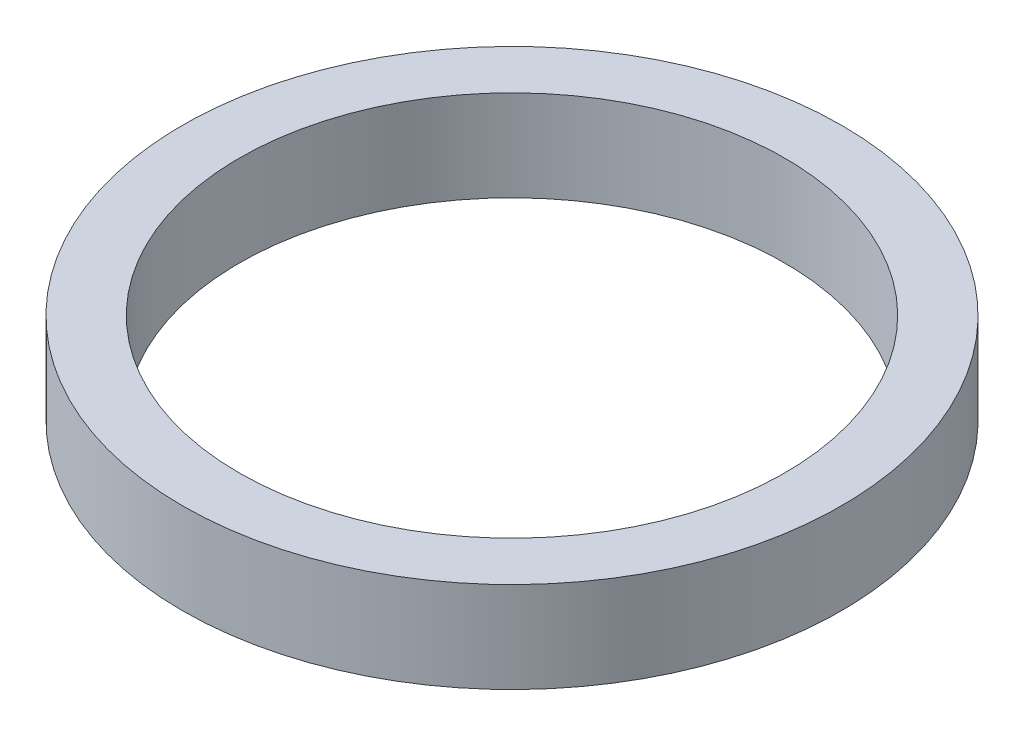
ISO-10303-21;
HEADER;
FILE_DESCRIPTION(('STEP AP214'),'2;1');
FILE_NAME('part.step','',(''),(''),'','','');
FILE_SCHEMA(('AUTOMOTIVE_DESIGN { 1 0 10303 214 1 1 1 1 }'));
ENDSEC;
DATA;
#1=APPLICATION_CONTEXT('core data for automotive mechanical design processes');
#2=APPLICATION_PROTOCOL_DEFINITION('international standard','automotive_design',2000,#1);
#3=PRODUCT_CONTEXT('',#1,'mechanical');
#4=PRODUCT('Part','Part','',(#3));
#5=PRODUCT_RELATED_PRODUCT_CATEGORY('part','',(#4));
#6=PRODUCT_DEFINITION_FORMATION('','',#4);
#7=PRODUCT_DEFINITION_CONTEXT('part definition',#1,'design');
#8=PRODUCT_DEFINITION('design','',#6,#7);
#9=PRODUCT_DEFINITION_SHAPE('','',#8);
#10=(LENGTH_UNIT() NAMED_UNIT(*) SI_UNIT(.MILLI.,.METRE.));
#11=(NAMED_UNIT(*) PLANE_ANGLE_UNIT() SI_UNIT($,.RADIAN.));
#12=(NAMED_UNIT(*) SI_UNIT($,.STERADIAN.) SOLID_ANGLE_UNIT());
#13=UNCERTAINTY_MEASURE_WITH_UNIT(LENGTH_MEASURE(1.E-05),#10,'distance_accuracy_value','');
#14=(GEOMETRIC_REPRESENTATION_CONTEXT(3) GLOBAL_UNCERTAINTY_ASSIGNED_CONTEXT((#13)) GLOBAL_UNIT_ASSIGNED_CONTEXT((#10,
#11,#12)) REPRESENTATION_CONTEXT('',''));
#15=CARTESIAN_POINT('',(0.,0.,0.));
#16=DIRECTION('',(0.,0.,1.));
#17=DIRECTION('',(1.,0.,0.));
#18=AXIS2_PLACEMENT_3D('',#15,#16,#17);
#19=CARTESIAN_POINT('',(0.,1.,0.));
#20=DIRECTION('',(0.,1.,0.));
#21=DIRECTION('',(0.,0.,1.));
#22=AXIS2_PLACEMENT_3D('',#19,#20,#21);
#23=PLANE('',#22);
#24=CARTESIAN_POINT('',(0.,1.,0.));
#25=DIRECTION('',(0.,1.,0.));
#26=DIRECTION('',(0.,0.,1.));
#27=AXIS2_PLACEMENT_3D('',#24,#25,#26);
#28=CIRCLE('',#27,3.625);
#29=CARTESIAN_POINT('',(0.,1.,3.625));
#30=VERTEX_POINT('',#29);
#31=EDGE_CURVE('E10',#30,#30,#28,.T.);
#32=ORIENTED_EDGE('',*,*,#31,.T.);
#33=EDGE_LOOP('',(#32));
#34=FACE_BOUND('',#33,.T.);
#35=CARTESIAN_POINT('',(0.,1.,0.));
#36=DIRECTION('',(0.,1.,0.));
#37=DIRECTION('',(0.,0.,1.));
#38=AXIS2_PLACEMENT_3D('',#35,#36,#37);
#39=CIRCLE('',#38,3.);
#40=CARTESIAN_POINT('',(0.,1.,3.));
#41=VERTEX_POINT('',#40);
#42=EDGE_CURVE('E56',#41,#41,#39,.T.);
#43=ORIENTED_EDGE('',*,*,#42,.F.);
#44=EDGE_LOOP('',(#43));
#45=FACE_BOUND('',#44,.T.);
#46=ADVANCED_FACE('F43',(#34,#45),#23,.T.);
#47=CARTESIAN_POINT('',(0.,0.,0.));
#48=DIRECTION('',(0.,1.,0.));
#49=DIRECTION('',(0.,0.,1.));
#50=AXIS2_PLACEMENT_3D('',#47,#48,#49);
#51=PLANE('',#50);
#52=CARTESIAN_POINT('',(0.,0.,0.));
#53=DIRECTION('',(0.,1.,0.));
#54=DIRECTION('',(0.,0.,1.));
#55=AXIS2_PLACEMENT_3D('',#52,#53,#54);
#56=CIRCLE('',#55,3.625);
#57=CARTESIAN_POINT('',(0.,0.,3.625));
#58=VERTEX_POINT('',#57);
#59=EDGE_CURVE('E47',#58,#58,#56,.T.);
#60=ORIENTED_EDGE('',*,*,#59,.F.);
#61=EDGE_LOOP('',(#60));
#62=FACE_BOUND('',#61,.T.);
#63=CARTESIAN_POINT('',(0.,0.,0.));
#64=DIRECTION('',(0.,1.,0.));
#65=DIRECTION('',(0.,0.,1.));
#66=AXIS2_PLACEMENT_3D('',#63,#64,#65);
#67=CIRCLE('',#66,3.);
#68=CARTESIAN_POINT('',(0.,0.,3.));
#69=VERTEX_POINT('',#68);
#70=EDGE_CURVE('E58',#69,#69,#67,.T.);
#71=ORIENTED_EDGE('',*,*,#70,.T.);
#72=EDGE_LOOP('',(#71));
#73=FACE_BOUND('',#72,.T.);
#74=ADVANCED_FACE('F70',(#62,#73),#51,.F.);
#75=CARTESIAN_POINT('',(0.,1.,0.));
#76=DIRECTION('',(0.,-1.,0.));
#77=DIRECTION('',(0.,0.,-1.));
#78=AXIS2_PLACEMENT_3D('',#75,#76,#77);
#79=CYLINDRICAL_SURFACE('',#78,3.625);
#80=ORIENTED_EDGE('',*,*,#31,.F.);
#81=EDGE_LOOP('',(#80));
#82=FACE_BOUND('',#81,.T.);
#83=ORIENTED_EDGE('',*,*,#59,.T.);
#84=EDGE_LOOP('',(#83));
#85=FACE_BOUND('',#84,.T.);
#86=ADVANCED_FACE('F45',(#82,#85),#79,.T.);
#87=CARTESIAN_POINT('',(0.,1.,0.));
#88=DIRECTION('',(0.,-1.,0.));
#89=DIRECTION('',(0.,0.,-1.));
#90=AXIS2_PLACEMENT_3D('',#87,#88,#89);
#91=CYLINDRICAL_SURFACE('',#90,3.);
#92=ORIENTED_EDGE('',*,*,#42,.T.);
#93=EDGE_LOOP('',(#92));
#94=FACE_BOUND('',#93,.T.);
#95=ORIENTED_EDGE('',*,*,#70,.F.);
#96=EDGE_LOOP('',(#95));
#97=FACE_BOUND('',#96,.T.);
#98=ADVANCED_FACE('F66',(#94,#97),#91,.F.);
#99=CLOSED_SHELL('',(#46,#74,#86,#98));
#100=MANIFOLD_SOLID_BREP('B2',#99);
#101=ADVANCED_BREP_SHAPE_REPRESENTATION('',(#18,#100),#14);
#102=SHAPE_DEFINITION_REPRESENTATION(#9,#101);
ENDSEC;
END-ISO-10303-21;
